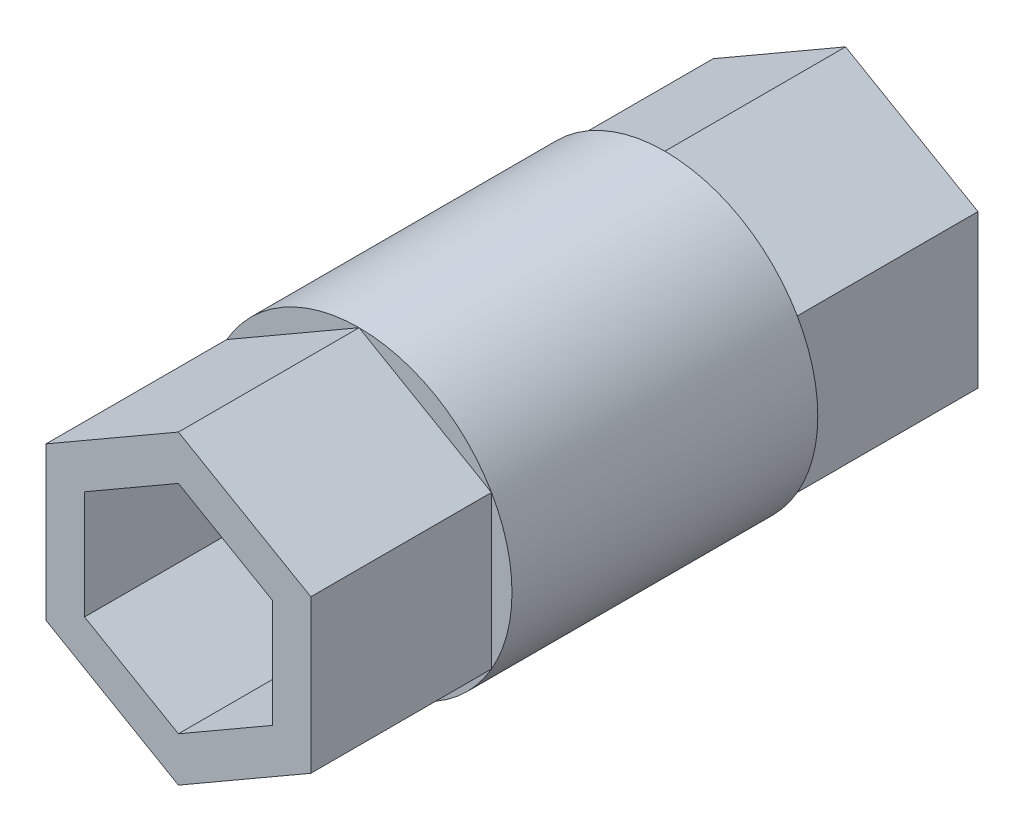
ISO-10303-21;
HEADER;
FILE_DESCRIPTION(('STEP AP214'),'2;1');
FILE_NAME('part.step','',(''),(''),'','','');
FILE_SCHEMA(('AUTOMOTIVE_DESIGN { 1 0 10303 214 1 1 1 1 }'));
ENDSEC;
DATA;
#1=APPLICATION_CONTEXT('core data for automotive mechanical design processes');
#2=APPLICATION_PROTOCOL_DEFINITION('international standard','automotive_design',2000,#1);
#3=PRODUCT_CONTEXT('',#1,'mechanical');
#4=PRODUCT('Part','Part','',(#3));
#5=PRODUCT_RELATED_PRODUCT_CATEGORY('part','',(#4));
#6=PRODUCT_DEFINITION_FORMATION('','',#4);
#7=PRODUCT_DEFINITION_CONTEXT('part definition',#1,'design');
#8=PRODUCT_DEFINITION('design','',#6,#7);
#9=PRODUCT_DEFINITION_SHAPE('','',#8);
#10=(LENGTH_UNIT() NAMED_UNIT(*) SI_UNIT(.MILLI.,.METRE.));
#11=(NAMED_UNIT(*) PLANE_ANGLE_UNIT() SI_UNIT($,.RADIAN.));
#12=(NAMED_UNIT(*) SI_UNIT($,.STERADIAN.) SOLID_ANGLE_UNIT());
#13=UNCERTAINTY_MEASURE_WITH_UNIT(LENGTH_MEASURE(1.E-05),#10,'distance_accuracy_value','');
#14=(GEOMETRIC_REPRESENTATION_CONTEXT(3) GLOBAL_UNCERTAINTY_ASSIGNED_CONTEXT((#13)) GLOBAL_UNIT_ASSIGNED_CONTEXT((#10,
#11,#12)) REPRESENTATION_CONTEXT('',''));
#15=CARTESIAN_POINT('',(0.,0.,0.));
#16=DIRECTION('',(0.,0.,1.));
#17=DIRECTION('',(1.,0.,0.));
#18=AXIS2_PLACEMENT_3D('',#15,#16,#17);
#19=CARTESIAN_POINT('',(0.,0.,11.));
#20=DIRECTION('',(0.,0.,1.));
#21=DIRECTION('',(1.,0.,0.));
#22=AXIS2_PLACEMENT_3D('',#19,#20,#21);
#23=PLANE('',#22);
#24=CARTESIAN_POINT('',(0.,0.,11.));
#25=DIRECTION('',(0.,0.,1.));
#26=DIRECTION('',(1.,0.,0.));
#27=AXIS2_PLACEMENT_3D('',#24,#25,#26);
#28=CIRCLE('',#27,11.);
#29=CARTESIAN_POINT('',(-9.52627944162882,-5.5,11.));
#30=VERTEX_POINT('',#29);
#31=CARTESIAN_POINT('',(0.,-11.,11.));
#32=VERTEX_POINT('',#31);
#33=EDGE_CURVE('E431',#30,#32,#28,.T.);
#34=ORIENTED_EDGE('',*,*,#33,.T.);
#35=DIRECTION('',(-0.866025403784439,0.5,0.));
#36=VECTOR('',#35,1.);
#37=CARTESIAN_POINT('',(-4.76313972081441,-8.25,11.));
#38=LINE('',#37,#36);
#39=EDGE_CURVE('E310',#32,#30,#38,.T.);
#40=ORIENTED_EDGE('',*,*,#39,.T.);
#41=EDGE_LOOP('',(#34,#40));
#42=FACE_BOUND('',#41,.T.);
#43=ADVANCED_FACE('F59',(#42),#23,.T.);
#44=CARTESIAN_POINT('',(9.52627944162883,-5.5,11.));
#45=VERTEX_POINT('',#44);
#46=EDGE_CURVE('E432',#32,#45,#28,.T.);
#47=ORIENTED_EDGE('',*,*,#46,.T.);
#48=DIRECTION('',(-0.866025403784439,-0.5,0.));
#49=VECTOR('',#48,1.);
#50=CARTESIAN_POINT('',(4.76313972081441,-8.25,11.));
#51=LINE('',#50,#49);
#52=EDGE_CURVE('E307',#45,#32,#51,.T.);
#53=ORIENTED_EDGE('',*,*,#52,.T.);
#54=EDGE_LOOP('',(#47,#53));
#55=FACE_BOUND('',#54,.T.);
#56=ADVANCED_FACE('F407',(#55),#23,.T.);
#57=CARTESIAN_POINT('',(9.52627944162882,5.5,11.));
#58=VERTEX_POINT('',#57);
#59=EDGE_CURVE('E319',#45,#58,#28,.T.);
#60=ORIENTED_EDGE('',*,*,#59,.T.);
#61=DIRECTION('',(0.,-1.,0.));
#62=VECTOR('',#61,1.);
#63=CARTESIAN_POINT('',(9.52627944162882,0.,11.));
#64=LINE('',#63,#62);
#65=EDGE_CURVE('E304',#58,#45,#64,.T.);
#66=ORIENTED_EDGE('',*,*,#65,.T.);
#67=EDGE_LOOP('',(#60,#66));
#68=FACE_BOUND('',#67,.T.);
#69=ADVANCED_FACE('F412',(#68),#23,.T.);
#70=CARTESIAN_POINT('',(0.,11.,11.));
#71=VERTEX_POINT('',#70);
#72=EDGE_CURVE('E314',#58,#71,#28,.T.);
#73=ORIENTED_EDGE('',*,*,#72,.T.);
#74=DIRECTION('',(0.866025403784439,-0.5,0.));
#75=VECTOR('',#74,1.);
#76=CARTESIAN_POINT('',(4.76313972081441,8.25,11.));
#77=LINE('',#76,#75);
#78=EDGE_CURVE('E301',#71,#58,#77,.T.);
#79=ORIENTED_EDGE('',*,*,#78,.T.);
#80=EDGE_LOOP('',(#73,#79));
#81=FACE_BOUND('',#80,.T.);
#82=ADVANCED_FACE('F422',(#81),#23,.T.);
#83=CARTESIAN_POINT('',(-9.52627944162882,5.5,11.));
#84=VERTEX_POINT('',#83);
#85=EDGE_CURVE('E318',#71,#84,#28,.T.);
#86=ORIENTED_EDGE('',*,*,#85,.T.);
#87=DIRECTION('',(0.866025403784439,0.5,0.));
#88=VECTOR('',#87,1.);
#89=CARTESIAN_POINT('',(-4.76313972081441,8.25,11.));
#90=LINE('',#89,#88);
#91=EDGE_CURVE('E298',#84,#71,#90,.T.);
#92=ORIENTED_EDGE('',*,*,#91,.T.);
#93=EDGE_LOOP('',(#86,#92));
#94=FACE_BOUND('',#93,.T.);
#95=ADVANCED_FACE('F417',(#94),#23,.T.);
#96=EDGE_CURVE('E426',#84,#30,#28,.T.);
#97=ORIENTED_EDGE('',*,*,#96,.T.);
#98=DIRECTION('',(0.,1.,0.));
#99=VECTOR('',#98,1.);
#100=CARTESIAN_POINT('',(-9.52627944162882,0.,11.));
#101=LINE('',#100,#99);
#102=EDGE_CURVE('E295',#30,#84,#101,.T.);
#103=ORIENTED_EDGE('',*,*,#102,.T.);
#104=EDGE_LOOP('',(#97,#103));
#105=FACE_BOUND('',#104,.T.);
#106=ADVANCED_FACE('F404',(#105),#23,.T.);
#107=CARTESIAN_POINT('',(0.,0.,-11.));
#108=DIRECTION('',(0.,0.,1.));
#109=DIRECTION('',(1.,0.,0.));
#110=AXIS2_PLACEMENT_3D('',#107,#108,#109);
#111=PLANE('',#110);
#112=DIRECTION('',(-0.866025403784439,0.5,0.));
#113=VECTOR('',#112,1.);
#114=CARTESIAN_POINT('',(-4.76313972081441,-8.25,-11.));
#115=LINE('',#114,#113);
#116=CARTESIAN_POINT('',(0.,-11.,-11.));
#117=VERTEX_POINT('',#116);
#118=CARTESIAN_POINT('',(-9.52627944162882,-5.50000000000001,-11.));
#119=VERTEX_POINT('',#118);
#120=EDGE_CURVE('E12',#117,#119,#115,.T.);
#121=ORIENTED_EDGE('',*,*,#120,.F.);
#122=CARTESIAN_POINT('',(0.,0.,-11.));
#123=DIRECTION('',(0.,0.,1.));
#124=DIRECTION('',(1.,0.,0.));
#125=AXIS2_PLACEMENT_3D('',#122,#123,#124);
#126=CIRCLE('',#125,11.);
#127=EDGE_CURVE('E384',#119,#117,#126,.T.);
#128=ORIENTED_EDGE('',*,*,#127,.F.);
#129=EDGE_LOOP('',(#121,#128));
#130=FACE_BOUND('',#129,.T.);
#131=ADVANCED_FACE('F385',(#130),#111,.F.);
#132=DIRECTION('',(-0.866025403784439,-0.5,0.));
#133=VECTOR('',#132,1.);
#134=CARTESIAN_POINT('',(4.76313972081441,-8.25,-11.));
#135=LINE('',#134,#133);
#136=CARTESIAN_POINT('',(9.52627944162883,-5.5,-11.));
#137=VERTEX_POINT('',#136);
#138=EDGE_CURVE('E67',#137,#117,#135,.T.);
#139=ORIENTED_EDGE('',*,*,#138,.F.);
#140=EDGE_CURVE('E361',#117,#137,#126,.T.);
#141=ORIENTED_EDGE('',*,*,#140,.F.);
#142=EDGE_LOOP('',(#139,#141));
#143=FACE_BOUND('',#142,.T.);
#144=ADVANCED_FACE('F398',(#143),#111,.F.);
#145=DIRECTION('',(0.,-1.,0.));
#146=VECTOR('',#145,1.);
#147=CARTESIAN_POINT('',(9.52627944162882,0.,-11.));
#148=LINE('',#147,#146);
#149=CARTESIAN_POINT('',(9.52627944162882,5.50000000000001,-11.));
#150=VERTEX_POINT('',#149);
#151=EDGE_CURVE('E332',#150,#137,#148,.T.);
#152=ORIENTED_EDGE('',*,*,#151,.F.);
#153=EDGE_CURVE('E313',#137,#150,#126,.T.);
#154=ORIENTED_EDGE('',*,*,#153,.F.);
#155=EDGE_LOOP('',(#152,#154));
#156=FACE_BOUND('',#155,.T.);
#157=ADVANCED_FACE('F356',(#156),#111,.F.);
#158=DIRECTION('',(0.866025403784439,-0.5,0.));
#159=VECTOR('',#158,1.);
#160=CARTESIAN_POINT('',(4.76313972081441,8.25,-11.));
#161=LINE('',#160,#159);
#162=CARTESIAN_POINT('',(0.,11.,-11.));
#163=VERTEX_POINT('',#162);
#164=EDGE_CURVE('E329',#163,#150,#161,.T.);
#165=ORIENTED_EDGE('',*,*,#164,.F.);
#166=EDGE_CURVE('E320',#150,#163,#126,.T.);
#167=ORIENTED_EDGE('',*,*,#166,.F.);
#168=EDGE_LOOP('',(#165,#167));
#169=FACE_BOUND('',#168,.T.);
#170=ADVANCED_FACE('F364',(#169),#111,.F.);
#171=DIRECTION('',(0.866025403784439,0.5,0.));
#172=VECTOR('',#171,1.);
#173=CARTESIAN_POINT('',(-4.76313972081441,8.25,-11.));
#174=LINE('',#173,#172);
#175=CARTESIAN_POINT('',(-9.52627944162882,5.5,-11.));
#176=VERTEX_POINT('',#175);
#177=EDGE_CURVE('E326',#176,#163,#174,.T.);
#178=ORIENTED_EDGE('',*,*,#177,.F.);
#179=EDGE_CURVE('E323',#163,#176,#126,.T.);
#180=ORIENTED_EDGE('',*,*,#179,.F.);
#181=EDGE_LOOP('',(#178,#180));
#182=FACE_BOUND('',#181,.T.);
#183=ADVANCED_FACE('F374',(#182),#111,.F.);
#184=DIRECTION('',(0.,1.,0.));
#185=VECTOR('',#184,1.);
#186=CARTESIAN_POINT('',(-9.52627944162882,0.,-11.));
#187=LINE('',#186,#185);
#188=EDGE_CURVE('E317',#119,#176,#187,.T.);
#189=ORIENTED_EDGE('',*,*,#188,.F.);
#190=EDGE_CURVE('E382',#176,#119,#126,.T.);
#191=ORIENTED_EDGE('',*,*,#190,.F.);
#192=EDGE_LOOP('',(#189,#191));
#193=FACE_BOUND('',#192,.T.);
#194=ADVANCED_FACE('F380',(#193),#111,.F.);
#195=CARTESIAN_POINT('',(0.,0.,11.));
#196=DIRECTION('',(0.,0.,-1.));
#197=DIRECTION('',(-1.,0.,0.));
#198=AXIS2_PLACEMENT_3D('',#195,#196,#197);
#199=CYLINDRICAL_SURFACE('',#198,11.);
#200=ORIENTED_EDGE('',*,*,#46,.F.);
#201=ORIENTED_EDGE('',*,*,#33,.F.);
#202=ORIENTED_EDGE('',*,*,#96,.F.);
#203=ORIENTED_EDGE('',*,*,#85,.F.);
#204=ORIENTED_EDGE('',*,*,#72,.F.);
#205=ORIENTED_EDGE('',*,*,#59,.F.);
#206=EDGE_LOOP('',(#200,#201,#202,#203,#204,#205));
#207=FACE_BOUND('',#206,.T.);
#208=ORIENTED_EDGE('',*,*,#127,.T.);
#209=ORIENTED_EDGE('',*,*,#140,.T.);
#210=ORIENTED_EDGE('',*,*,#153,.T.);
#211=ORIENTED_EDGE('',*,*,#166,.T.);
#212=ORIENTED_EDGE('',*,*,#179,.T.);
#213=ORIENTED_EDGE('',*,*,#190,.T.);
#214=EDGE_LOOP('',(#208,#209,#210,#211,#212,#213));
#215=FACE_BOUND('',#214,.T.);
#216=ADVANCED_FACE('F61',(#207,#215),#199,.T.);
#217=CARTESIAN_POINT('',(0.,0.,-24.));
#218=DIRECTION('',(0.,0.,1.));
#219=DIRECTION('',(1.,0.,0.));
#220=AXIS2_PLACEMENT_3D('',#217,#218,#219);
#221=PLANE('',#220);
#222=DIRECTION('',(0.,-1.,0.));
#223=VECTOR('',#222,1.);
#224=CARTESIAN_POINT('',(-6.75499814951862,3.9,-24.));
#225=LINE('',#224,#223);
#226=CARTESIAN_POINT('',(-6.75499814951862,3.9,-24.));
#227=VERTEX_POINT('',#226);
#228=CARTESIAN_POINT('',(-6.75499814951862,-3.9,-24.));
#229=VERTEX_POINT('',#228);
#230=EDGE_CURVE('E192',#227,#229,#225,.T.);
#231=ORIENTED_EDGE('',*,*,#230,.T.);
#232=DIRECTION('',(0.866025403784439,-0.5,0.));
#233=VECTOR('',#232,1.);
#234=CARTESIAN_POINT('',(-6.75499814951862,-3.9,-24.));
#235=LINE('',#234,#233);
#236=CARTESIAN_POINT('',(0.,-7.8,-24.));
#237=VERTEX_POINT('',#236);
#238=EDGE_CURVE('E186',#229,#237,#235,.T.);
#239=ORIENTED_EDGE('',*,*,#238,.T.);
#240=DIRECTION('',(0.866025403784439,0.5,0.));
#241=VECTOR('',#240,1.);
#242=CARTESIAN_POINT('',(0.,-7.8,-24.));
#243=LINE('',#242,#241);
#244=CARTESIAN_POINT('',(6.75499814951862,-3.9,-24.));
#245=VERTEX_POINT('',#244);
#246=EDGE_CURVE('E195',#237,#245,#243,.T.);
#247=ORIENTED_EDGE('',*,*,#246,.T.);
#248=DIRECTION('',(0.,1.,0.));
#249=VECTOR('',#248,1.);
#250=CARTESIAN_POINT('',(6.75499814951862,-3.9,-24.));
#251=LINE('',#250,#249);
#252=CARTESIAN_POINT('',(6.75499814951862,3.9,-24.));
#253=VERTEX_POINT('',#252);
#254=EDGE_CURVE('E74',#245,#253,#251,.T.);
#255=ORIENTED_EDGE('',*,*,#254,.T.);
#256=DIRECTION('',(-0.866025403784439,0.5,0.));
#257=VECTOR('',#256,1.);
#258=CARTESIAN_POINT('',(6.75499814951862,3.9,-24.));
#259=LINE('',#258,#257);
#260=CARTESIAN_POINT('',(0.,7.8,-24.));
#261=VERTEX_POINT('',#260);
#262=EDGE_CURVE('E211',#253,#261,#259,.T.);
#263=ORIENTED_EDGE('',*,*,#262,.T.);
#264=DIRECTION('',(-0.866025403784439,-0.5,0.));
#265=VECTOR('',#264,1.);
#266=CARTESIAN_POINT('',(0.,7.8,-24.));
#267=LINE('',#266,#265);
#268=EDGE_CURVE('E214',#261,#227,#267,.T.);
#269=ORIENTED_EDGE('',*,*,#268,.T.);
#270=EDGE_LOOP('',(#231,#239,#247,#255,#263,#269));
#271=FACE_BOUND('',#270,.T.);
#272=DIRECTION('',(0.,-1.,0.));
#273=VECTOR('',#272,1.);
#274=CARTESIAN_POINT('',(-9.52627944162882,0.,-24.));
#275=LINE('',#274,#273);
#276=CARTESIAN_POINT('',(-9.52627944162882,5.5,-24.));
#277=VERTEX_POINT('',#276);
#278=CARTESIAN_POINT('',(-9.52627944162882,-5.5,-24.));
#279=VERTEX_POINT('',#278);
#280=EDGE_CURVE('E232',#277,#279,#275,.T.);
#281=ORIENTED_EDGE('',*,*,#280,.F.);
#282=DIRECTION('',(-0.866025403784439,-0.5,0.));
#283=VECTOR('',#282,1.);
#284=CARTESIAN_POINT('',(-4.76313972081441,8.25,-24.));
#285=LINE('',#284,#283);
#286=CARTESIAN_POINT('',(0.,11.,-24.));
#287=VERTEX_POINT('',#286);
#288=EDGE_CURVE('E245',#287,#277,#285,.T.);
#289=ORIENTED_EDGE('',*,*,#288,.F.);
#290=DIRECTION('',(-0.866025403784439,0.5,0.));
#291=VECTOR('',#290,1.);
#292=CARTESIAN_POINT('',(4.76313972081441,8.25,-24.));
#293=LINE('',#292,#291);
#294=CARTESIAN_POINT('',(9.52627944162882,5.5,-24.));
#295=VERTEX_POINT('',#294);
#296=EDGE_CURVE('E268',#295,#287,#293,.T.);
#297=ORIENTED_EDGE('',*,*,#296,.F.);
#298=DIRECTION('',(0.,1.,0.));
#299=VECTOR('',#298,1.);
#300=CARTESIAN_POINT('',(9.52627944162882,0.,-24.));
#301=LINE('',#300,#299);
#302=CARTESIAN_POINT('',(9.52627944162883,-5.5,-24.));
#303=VERTEX_POINT('',#302);
#304=EDGE_CURVE('E265',#303,#295,#301,.T.);
#305=ORIENTED_EDGE('',*,*,#304,.F.);
#306=DIRECTION('',(0.866025403784439,0.5,0.));
#307=VECTOR('',#306,1.);
#308=CARTESIAN_POINT('',(4.76313972081441,-8.25,-24.));
#309=LINE('',#308,#307);
#310=CARTESIAN_POINT('',(0.,-11.,-24.));
#311=VERTEX_POINT('',#310);
#312=EDGE_CURVE('E262',#311,#303,#309,.T.);
#313=ORIENTED_EDGE('',*,*,#312,.F.);
#314=DIRECTION('',(0.866025403784439,-0.5,0.));
#315=VECTOR('',#314,1.);
#316=CARTESIAN_POINT('',(-4.76313972081441,-8.25,-24.));
#317=LINE('',#316,#315);
#318=EDGE_CURVE('E259',#279,#311,#317,.T.);
#319=ORIENTED_EDGE('',*,*,#318,.F.);
#320=EDGE_LOOP('',(#281,#289,#297,#305,#313,#319));
#321=FACE_BOUND('',#320,.T.);
#322=ADVANCED_FACE('F200',(#271,#321),#221,.F.);
#323=CARTESIAN_POINT('',(-9.52627944162882,0.,24.));
#324=DIRECTION('',(1.,0.,0.));
#325=DIRECTION('',(0.,1.,0.));
#326=AXIS2_PLACEMENT_3D('',#323,#324,#325);
#327=PLANE('',#326);
#328=DIRECTION('',(0.,0.,-1.));
#329=VECTOR('',#328,1.);
#330=CARTESIAN_POINT('',(-9.52627944162882,-5.5,24.));
#331=LINE('',#330,#329);
#332=EDGE_CURVE('E291',#119,#279,#331,.T.);
#333=ORIENTED_EDGE('',*,*,#332,.F.);
#334=ORIENTED_EDGE('',*,*,#188,.T.);
#335=DIRECTION('',(0.,0.,-1.));
#336=VECTOR('',#335,1.);
#337=CARTESIAN_POINT('',(-9.52627944162882,5.5,24.));
#338=LINE('',#337,#336);
#339=EDGE_CURVE('E256',#176,#277,#338,.T.);
#340=ORIENTED_EDGE('',*,*,#339,.T.);
#341=ORIENTED_EDGE('',*,*,#280,.T.);
#342=EDGE_LOOP('',(#333,#334,#340,#341));
#343=FACE_BOUND('',#342,.T.);
#344=ADVANCED_FACE('F376',(#343),#327,.F.);
#345=CARTESIAN_POINT('',(-4.76313972081441,8.25,24.));
#346=DIRECTION('',(0.5,-0.866025403784439,0.));
#347=DIRECTION('',(0.866025403784439,0.5,0.));
#348=AXIS2_PLACEMENT_3D('',#345,#346,#347);
#349=PLANE('',#348);
#350=ORIENTED_EDGE('',*,*,#339,.F.);
#351=ORIENTED_EDGE('',*,*,#177,.T.);
#352=DIRECTION('',(0.,0.,-1.));
#353=VECTOR('',#352,1.);
#354=CARTESIAN_POINT('',(0.,11.,24.));
#355=LINE('',#354,#353);
#356=EDGE_CURVE('E275',#163,#287,#355,.T.);
#357=ORIENTED_EDGE('',*,*,#356,.T.);
#358=ORIENTED_EDGE('',*,*,#288,.T.);
#359=EDGE_LOOP('',(#350,#351,#357,#358));
#360=FACE_BOUND('',#359,.T.);
#361=ADVANCED_FACE('F371',(#360),#349,.F.);
#362=CARTESIAN_POINT('',(4.76313972081441,8.25,24.));
#363=DIRECTION('',(-0.5,-0.866025403784439,0.));
#364=DIRECTION('',(0.866025403784439,-0.5,0.));
#365=AXIS2_PLACEMENT_3D('',#362,#363,#364);
#366=PLANE('',#365);
#367=ORIENTED_EDGE('',*,*,#356,.F.);
#368=ORIENTED_EDGE('',*,*,#164,.T.);
#369=DIRECTION('',(0.,0.,-1.));
#370=VECTOR('',#369,1.);
#371=CARTESIAN_POINT('',(9.52627944162882,5.5,24.));
#372=LINE('',#371,#370);
#373=EDGE_CURVE('E279',#150,#295,#372,.T.);
#374=ORIENTED_EDGE('',*,*,#373,.T.);
#375=ORIENTED_EDGE('',*,*,#296,.T.);
#376=EDGE_LOOP('',(#367,#368,#374,#375));
#377=FACE_BOUND('',#376,.T.);
#378=ADVANCED_FACE('F368',(#377),#366,.F.);
#379=CARTESIAN_POINT('',(9.52627944162882,0.,24.));
#380=DIRECTION('',(-1.,0.,0.));
#381=DIRECTION('',(0.,-1.,0.));
#382=AXIS2_PLACEMENT_3D('',#379,#380,#381);
#383=PLANE('',#382);
#384=ORIENTED_EDGE('',*,*,#373,.F.);
#385=ORIENTED_EDGE('',*,*,#151,.T.);
#386=DIRECTION('',(0.,0.,-1.));
#387=VECTOR('',#386,1.);
#388=CARTESIAN_POINT('',(9.52627944162883,-5.5,24.));
#389=LINE('',#388,#387);
#390=EDGE_CURVE('E283',#137,#303,#389,.T.);
#391=ORIENTED_EDGE('',*,*,#390,.T.);
#392=ORIENTED_EDGE('',*,*,#304,.T.);
#393=EDGE_LOOP('',(#384,#385,#391,#392));
#394=FACE_BOUND('',#393,.T.);
#395=ADVANCED_FACE('F353',(#394),#383,.F.);
#396=CARTESIAN_POINT('',(4.76313972081441,-8.25,24.));
#397=DIRECTION('',(-0.5,0.866025403784439,0.));
#398=DIRECTION('',(-0.866025403784439,-0.5,0.));
#399=AXIS2_PLACEMENT_3D('',#396,#397,#398);
#400=PLANE('',#399);
#401=ORIENTED_EDGE('',*,*,#390,.F.);
#402=ORIENTED_EDGE('',*,*,#138,.T.);
#403=DIRECTION('',(0.,0.,-1.));
#404=VECTOR('',#403,1.);
#405=CARTESIAN_POINT('',(0.,-11.,24.));
#406=LINE('',#405,#404);
#407=EDGE_CURVE('E287',#117,#311,#406,.T.);
#408=ORIENTED_EDGE('',*,*,#407,.T.);
#409=ORIENTED_EDGE('',*,*,#312,.T.);
#410=EDGE_LOOP('',(#401,#402,#408,#409));
#411=FACE_BOUND('',#410,.T.);
#412=ADVANCED_FACE('F338',(#411),#400,.F.);
#413=CARTESIAN_POINT('',(-4.76313972081441,-8.25,24.));
#414=DIRECTION('',(0.5,0.866025403784439,0.));
#415=DIRECTION('',(-0.866025403784439,0.5,0.));
#416=AXIS2_PLACEMENT_3D('',#413,#414,#415);
#417=PLANE('',#416);
#418=ORIENTED_EDGE('',*,*,#407,.F.);
#419=ORIENTED_EDGE('',*,*,#120,.T.);
#420=ORIENTED_EDGE('',*,*,#332,.T.);
#421=ORIENTED_EDGE('',*,*,#318,.T.);
#422=EDGE_LOOP('',(#418,#419,#420,#421));
#423=FACE_BOUND('',#422,.T.);
#424=ADVANCED_FACE('F343',(#423),#417,.F.);
#425=ORIENTED_EDGE('',*,*,#39,.F.);
#426=CARTESIAN_POINT('',(0.,-11.,24.));
#427=VERTEX_POINT('',#426);
#428=EDGE_CURVE('E288',#427,#32,#406,.T.);
#429=ORIENTED_EDGE('',*,*,#428,.F.);
#430=DIRECTION('',(0.866025403784439,-0.5,0.));
#431=VECTOR('',#430,1.);
#432=CARTESIAN_POINT('',(-4.76313972081441,-8.25,24.));
#433=LINE('',#432,#431);
#434=CARTESIAN_POINT('',(-9.52627944162882,-5.5,24.));
#435=VERTEX_POINT('',#434);
#436=EDGE_CURVE('E244',#435,#427,#433,.T.);
#437=ORIENTED_EDGE('',*,*,#436,.F.);
#438=EDGE_CURVE('E292',#435,#30,#331,.T.);
#439=ORIENTED_EDGE('',*,*,#438,.T.);
#440=EDGE_LOOP('',(#425,#429,#437,#439));
#441=FACE_BOUND('',#440,.T.);
#442=ADVANCED_FACE('F463',(#441),#417,.F.);
#443=ORIENTED_EDGE('',*,*,#52,.F.);
#444=CARTESIAN_POINT('',(9.52627944162883,-5.5,24.));
#445=VERTEX_POINT('',#444);
#446=EDGE_CURVE('E284',#445,#45,#389,.T.);
#447=ORIENTED_EDGE('',*,*,#446,.F.);
#448=DIRECTION('',(0.866025403784439,0.5,0.));
#449=VECTOR('',#448,1.);
#450=CARTESIAN_POINT('',(4.76313972081441,-8.25,24.));
#451=LINE('',#450,#449);
#452=EDGE_CURVE('E247',#427,#445,#451,.T.);
#453=ORIENTED_EDGE('',*,*,#452,.F.);
#454=ORIENTED_EDGE('',*,*,#428,.T.);
#455=EDGE_LOOP('',(#443,#447,#453,#454));
#456=FACE_BOUND('',#455,.T.);
#457=ADVANCED_FACE('F460',(#456),#400,.F.);
#458=ORIENTED_EDGE('',*,*,#65,.F.);
#459=CARTESIAN_POINT('',(9.52627944162882,5.5,24.));
#460=VERTEX_POINT('',#459);
#461=EDGE_CURVE('E280',#460,#58,#372,.T.);
#462=ORIENTED_EDGE('',*,*,#461,.F.);
#463=DIRECTION('',(0.,1.,0.));
#464=VECTOR('',#463,1.);
#465=CARTESIAN_POINT('',(9.52627944162882,0.,24.));
#466=LINE('',#465,#464);
#467=EDGE_CURVE('E249',#445,#460,#466,.T.);
#468=ORIENTED_EDGE('',*,*,#467,.F.);
#469=ORIENTED_EDGE('',*,*,#446,.T.);
#470=EDGE_LOOP('',(#458,#462,#468,#469));
#471=FACE_BOUND('',#470,.T.);
#472=ADVANCED_FACE('F458',(#471),#383,.F.);
#473=ORIENTED_EDGE('',*,*,#78,.F.);
#474=CARTESIAN_POINT('',(0.,11.,24.));
#475=VERTEX_POINT('',#474);
#476=EDGE_CURVE('E276',#475,#71,#355,.T.);
#477=ORIENTED_EDGE('',*,*,#476,.F.);
#478=DIRECTION('',(-0.866025403784439,0.5,0.));
#479=VECTOR('',#478,1.);
#480=CARTESIAN_POINT('',(4.76313972081441,8.25,24.));
#481=LINE('',#480,#479);
#482=EDGE_CURVE('E252',#460,#475,#481,.T.);
#483=ORIENTED_EDGE('',*,*,#482,.F.);
#484=ORIENTED_EDGE('',*,*,#461,.T.);
#485=EDGE_LOOP('',(#473,#477,#483,#484));
#486=FACE_BOUND('',#485,.T.);
#487=ADVANCED_FACE('F442',(#486),#366,.F.);
#488=ORIENTED_EDGE('',*,*,#91,.F.);
#489=CARTESIAN_POINT('',(-9.52627944162882,5.5,24.));
#490=VERTEX_POINT('',#489);
#491=EDGE_CURVE('E273',#490,#84,#338,.T.);
#492=ORIENTED_EDGE('',*,*,#491,.F.);
#493=DIRECTION('',(-0.866025403784439,-0.5,0.));
#494=VECTOR('',#493,1.);
#495=CARTESIAN_POINT('',(-4.76313972081441,8.25,24.));
#496=LINE('',#495,#494);
#497=EDGE_CURVE('E254',#475,#490,#496,.T.);
#498=ORIENTED_EDGE('',*,*,#497,.F.);
#499=ORIENTED_EDGE('',*,*,#476,.T.);
#500=EDGE_LOOP('',(#488,#492,#498,#499));
#501=FACE_BOUND('',#500,.T.);
#502=ADVANCED_FACE('F448',(#501),#349,.F.);
#503=ORIENTED_EDGE('',*,*,#102,.F.);
#504=ORIENTED_EDGE('',*,*,#438,.F.);
#505=DIRECTION('',(0.,-1.,0.));
#506=VECTOR('',#505,1.);
#507=CARTESIAN_POINT('',(-9.52627944162882,0.,24.));
#508=LINE('',#507,#506);
#509=EDGE_CURVE('E240',#490,#435,#508,.T.);
#510=ORIENTED_EDGE('',*,*,#509,.F.);
#511=ORIENTED_EDGE('',*,*,#491,.T.);
#512=EDGE_LOOP('',(#503,#504,#510,#511));
#513=FACE_BOUND('',#512,.T.);
#514=ADVANCED_FACE('F465',(#513),#327,.F.);
#515=CARTESIAN_POINT('',(0.,0.,24.));
#516=DIRECTION('',(0.,0.,1.));
#517=DIRECTION('',(1.,0.,0.));
#518=AXIS2_PLACEMENT_3D('',#515,#516,#517);
#519=PLANE('',#518);
#520=DIRECTION('',(0.866025403784439,-0.5,0.));
#521=VECTOR('',#520,1.);
#522=CARTESIAN_POINT('',(-6.75499814951862,-3.9,24.));
#523=LINE('',#522,#521);
#524=CARTESIAN_POINT('',(-6.75499814951862,-3.9,24.));
#525=VERTEX_POINT('',#524);
#526=CARTESIAN_POINT('',(0.,-7.8,24.));
#527=VERTEX_POINT('',#526);
#528=EDGE_CURVE('E82',#525,#527,#523,.T.);
#529=ORIENTED_EDGE('',*,*,#528,.F.);
#530=DIRECTION('',(0.,-1.,0.));
#531=VECTOR('',#530,1.);
#532=CARTESIAN_POINT('',(-6.75499814951862,3.9,24.));
#533=LINE('',#532,#531);
#534=CARTESIAN_POINT('',(-6.75499814951862,3.9,24.));
#535=VERTEX_POINT('',#534);
#536=EDGE_CURVE('E204',#535,#525,#533,.T.);
#537=ORIENTED_EDGE('',*,*,#536,.F.);
#538=DIRECTION('',(-0.866025403784439,-0.5,0.));
#539=VECTOR('',#538,1.);
#540=CARTESIAN_POINT('',(0.,7.8,24.));
#541=LINE('',#540,#539);
#542=CARTESIAN_POINT('',(0.,7.8,24.));
#543=VERTEX_POINT('',#542);
#544=EDGE_CURVE('E207',#543,#535,#541,.T.);
#545=ORIENTED_EDGE('',*,*,#544,.F.);
#546=DIRECTION('',(-0.866025403784439,0.5,0.));
#547=VECTOR('',#546,1.);
#548=CARTESIAN_POINT('',(6.75499814951862,3.9,24.));
#549=LINE('',#548,#547);
#550=CARTESIAN_POINT('',(6.75499814951862,3.9,24.));
#551=VERTEX_POINT('',#550);
#552=EDGE_CURVE('E225',#551,#543,#549,.T.);
#553=ORIENTED_EDGE('',*,*,#552,.F.);
#554=DIRECTION('',(0.,1.,0.));
#555=VECTOR('',#554,1.);
#556=CARTESIAN_POINT('',(6.75499814951862,-3.9,24.));
#557=LINE('',#556,#555);
#558=CARTESIAN_POINT('',(6.75499814951862,-3.9,24.));
#559=VERTEX_POINT('',#558);
#560=EDGE_CURVE('E221',#559,#551,#557,.T.);
#561=ORIENTED_EDGE('',*,*,#560,.F.);
#562=DIRECTION('',(0.866025403784439,0.5,0.));
#563=VECTOR('',#562,1.);
#564=CARTESIAN_POINT('',(0.,-7.8,24.));
#565=LINE('',#564,#563);
#566=EDGE_CURVE('E219',#527,#559,#565,.T.);
#567=ORIENTED_EDGE('',*,*,#566,.F.);
#568=EDGE_LOOP('',(#529,#537,#545,#553,#561,#567));
#569=FACE_BOUND('',#568,.T.);
#570=ORIENTED_EDGE('',*,*,#509,.T.);
#571=ORIENTED_EDGE('',*,*,#436,.T.);
#572=ORIENTED_EDGE('',*,*,#452,.T.);
#573=ORIENTED_EDGE('',*,*,#467,.T.);
#574=ORIENTED_EDGE('',*,*,#482,.T.);
#575=ORIENTED_EDGE('',*,*,#497,.T.);
#576=EDGE_LOOP('',(#570,#571,#572,#573,#574,#575));
#577=FACE_BOUND('',#576,.T.);
#578=ADVANCED_FACE('F452',(#569,#577),#519,.T.);
#579=CARTESIAN_POINT('',(-6.75499814951862,-3.9,-24.));
#580=DIRECTION('',(-0.5,-0.866025403784439,0.));
#581=DIRECTION('',(0.866025403784439,-0.5,0.));
#582=AXIS2_PLACEMENT_3D('',#579,#580,#581);
#583=PLANE('',#582);
#584=ORIENTED_EDGE('',*,*,#528,.T.);
#585=DIRECTION('',(0.,0.,1.));
#586=VECTOR('',#585,1.);
#587=CARTESIAN_POINT('',(0.,-7.8,-24.));
#588=LINE('',#587,#586);
#589=EDGE_CURVE('E182',#237,#527,#588,.T.);
#590=ORIENTED_EDGE('',*,*,#589,.F.);
#591=ORIENTED_EDGE('',*,*,#238,.F.);
#592=DIRECTION('',(0.,0.,1.));
#593=VECTOR('',#592,1.);
#594=CARTESIAN_POINT('',(-6.75499814951862,-3.9,-24.));
#595=LINE('',#594,#593);
#596=EDGE_CURVE('E230',#229,#525,#595,.T.);
#597=ORIENTED_EDGE('',*,*,#596,.T.);
#598=EDGE_LOOP('',(#584,#590,#591,#597));
#599=FACE_BOUND('',#598,.T.);
#600=ADVANCED_FACE('F184',(#599),#583,.F.);
#601=CARTESIAN_POINT('',(-6.75499814951862,3.9,-24.));
#602=DIRECTION('',(-1.,0.,0.));
#603=DIRECTION('',(0.,-1.,0.));
#604=AXIS2_PLACEMENT_3D('',#601,#602,#603);
#605=PLANE('',#604);
#606=ORIENTED_EDGE('',*,*,#536,.T.);
#607=ORIENTED_EDGE('',*,*,#596,.F.);
#608=ORIENTED_EDGE('',*,*,#230,.F.);
#609=DIRECTION('',(0.,0.,1.));
#610=VECTOR('',#609,1.);
#611=CARTESIAN_POINT('',(-6.75499814951862,3.9,-24.));
#612=LINE('',#611,#610);
#613=EDGE_CURVE('E233',#227,#535,#612,.T.);
#614=ORIENTED_EDGE('',*,*,#613,.T.);
#615=EDGE_LOOP('',(#606,#607,#608,#614));
#616=FACE_BOUND('',#615,.T.);
#617=ADVANCED_FACE('F644',(#616),#605,.F.);
#618=CARTESIAN_POINT('',(0.,7.8,-24.));
#619=DIRECTION('',(-0.5,0.866025403784438,0.));
#620=DIRECTION('',(-0.866025403784439,-0.5,0.));
#621=AXIS2_PLACEMENT_3D('',#618,#619,#620);
#622=PLANE('',#621);
#623=ORIENTED_EDGE('',*,*,#544,.T.);
#624=ORIENTED_EDGE('',*,*,#613,.F.);
#625=ORIENTED_EDGE('',*,*,#268,.F.);
#626=DIRECTION('',(0.,0.,1.));
#627=VECTOR('',#626,1.);
#628=CARTESIAN_POINT('',(0.,7.8,-24.));
#629=LINE('',#628,#627);
#630=EDGE_CURVE('E235',#261,#543,#629,.T.);
#631=ORIENTED_EDGE('',*,*,#630,.T.);
#632=EDGE_LOOP('',(#623,#624,#625,#631));
#633=FACE_BOUND('',#632,.T.);
#634=ADVANCED_FACE('F652',(#633),#622,.F.);
#635=CARTESIAN_POINT('',(6.75499814951862,3.9,-24.));
#636=DIRECTION('',(0.5,0.866025403784439,0.));
#637=DIRECTION('',(-0.866025403784439,0.5,0.));
#638=AXIS2_PLACEMENT_3D('',#635,#636,#637);
#639=PLANE('',#638);
#640=ORIENTED_EDGE('',*,*,#552,.T.);
#641=ORIENTED_EDGE('',*,*,#630,.F.);
#642=ORIENTED_EDGE('',*,*,#262,.F.);
#643=DIRECTION('',(0.,0.,1.));
#644=VECTOR('',#643,1.);
#645=CARTESIAN_POINT('',(6.75499814951862,3.9,-24.));
#646=LINE('',#645,#644);
#647=EDGE_CURVE('E237',#253,#551,#646,.T.);
#648=ORIENTED_EDGE('',*,*,#647,.T.);
#649=EDGE_LOOP('',(#640,#641,#642,#648));
#650=FACE_BOUND('',#649,.T.);
#651=ADVANCED_FACE('F662',(#650),#639,.F.);
#652=CARTESIAN_POINT('',(6.75499814951862,-3.9,-24.));
#653=DIRECTION('',(1.,0.,0.));
#654=DIRECTION('',(0.,1.,0.));
#655=AXIS2_PLACEMENT_3D('',#652,#653,#654);
#656=PLANE('',#655);
#657=ORIENTED_EDGE('',*,*,#560,.T.);
#658=ORIENTED_EDGE('',*,*,#647,.F.);
#659=ORIENTED_EDGE('',*,*,#254,.F.);
#660=DIRECTION('',(0.,0.,1.));
#661=VECTOR('',#660,1.);
#662=CARTESIAN_POINT('',(6.75499814951862,-3.9,-24.));
#663=LINE('',#662,#661);
#664=EDGE_CURVE('E191',#245,#559,#663,.T.);
#665=ORIENTED_EDGE('',*,*,#664,.T.);
#666=EDGE_LOOP('',(#657,#658,#659,#665));
#667=FACE_BOUND('',#666,.T.);
#668=ADVANCED_FACE('F672',(#667),#656,.F.);
#669=CARTESIAN_POINT('',(0.,-7.8,-24.));
#670=DIRECTION('',(0.5,-0.866025403784439,0.));
#671=DIRECTION('',(0.866025403784439,0.5,0.));
#672=AXIS2_PLACEMENT_3D('',#669,#670,#671);
#673=PLANE('',#672);
#674=ORIENTED_EDGE('',*,*,#566,.T.);
#675=ORIENTED_EDGE('',*,*,#664,.F.);
#676=ORIENTED_EDGE('',*,*,#246,.F.);
#677=ORIENTED_EDGE('',*,*,#589,.T.);
#678=EDGE_LOOP('',(#674,#675,#676,#677));
#679=FACE_BOUND('',#678,.T.);
#680=ADVANCED_FACE('F196',(#679),#673,.F.);
#681=CLOSED_SHELL('',(#43,#56,#69,#82,#95,#106,#131,#144,#157,#170,#183,#194,#216,#322,#344,
#361,#378,#395,#412,#424,#442,#457,#472,#487,#502,#514,#578,#600,#617,#634,#651,#668,#680));
#682=MANIFOLD_SOLID_BREP('B2',#681);
#683=ADVANCED_BREP_SHAPE_REPRESENTATION('',(#18,#682),#14);
#684=SHAPE_DEFINITION_REPRESENTATION(#9,#683);
ENDSEC;
END-ISO-10303-21;
